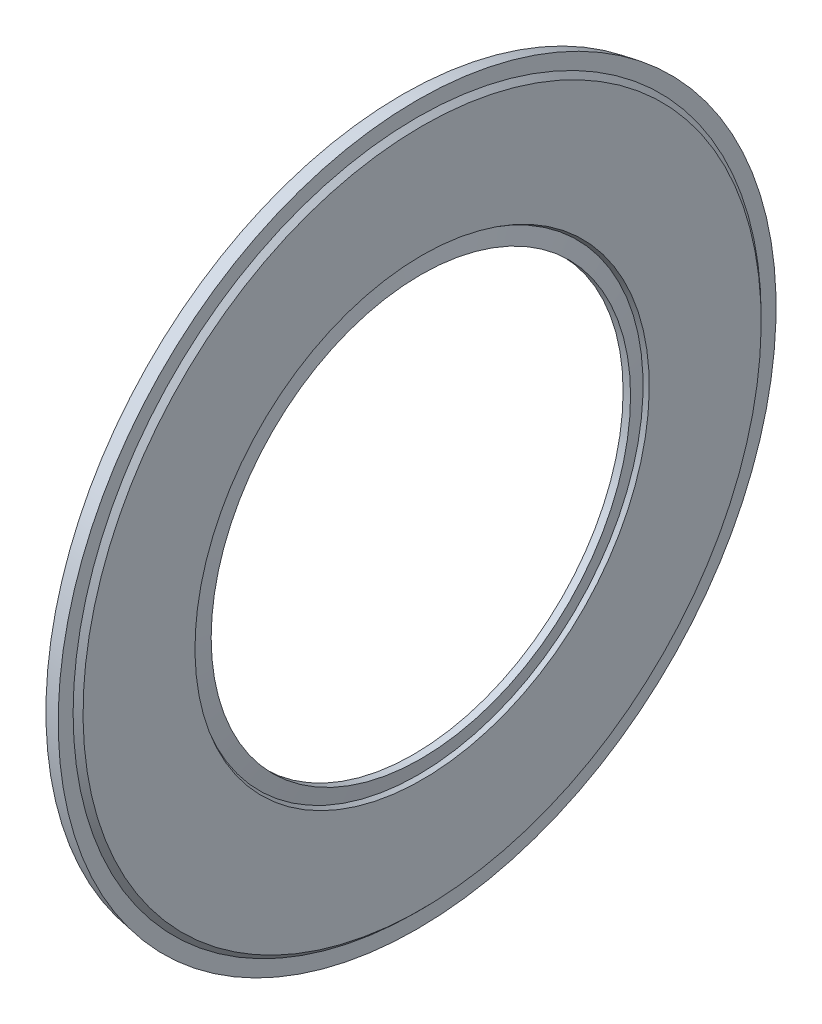
ISO-10303-21;
HEADER;
FILE_DESCRIPTION(('STEP AP214'),'2;1');
FILE_NAME('part.step','',(''),(''),'','','');
FILE_SCHEMA(('AUTOMOTIVE_DESIGN { 1 0 10303 214 1 1 1 1 }'));
ENDSEC;
DATA;
#1=APPLICATION_CONTEXT('core data for automotive mechanical design processes');
#2=APPLICATION_PROTOCOL_DEFINITION('international standard','automotive_design',2000,#1);
#3=PRODUCT_CONTEXT('',#1,'mechanical');
#4=PRODUCT('Part','Part','',(#3));
#5=PRODUCT_RELATED_PRODUCT_CATEGORY('part','',(#4));
#6=PRODUCT_DEFINITION_FORMATION('','',#4);
#7=PRODUCT_DEFINITION_CONTEXT('part definition',#1,'design');
#8=PRODUCT_DEFINITION('design','',#6,#7);
#9=PRODUCT_DEFINITION_SHAPE('','',#8);
#10=(LENGTH_UNIT() NAMED_UNIT(*) SI_UNIT(.MILLI.,.METRE.));
#11=(NAMED_UNIT(*) PLANE_ANGLE_UNIT() SI_UNIT($,.RADIAN.));
#12=(NAMED_UNIT(*) SI_UNIT($,.STERADIAN.) SOLID_ANGLE_UNIT());
#13=UNCERTAINTY_MEASURE_WITH_UNIT(LENGTH_MEASURE(1.E-05),#10,'distance_accuracy_value','');
#14=(GEOMETRIC_REPRESENTATION_CONTEXT(3) GLOBAL_UNCERTAINTY_ASSIGNED_CONTEXT((#13)) GLOBAL_UNIT_ASSIGNED_CONTEXT((#10,
#11,#12)) REPRESENTATION_CONTEXT('',''));
#15=CARTESIAN_POINT('',(0.,0.,0.));
#16=DIRECTION('',(0.,0.,1.));
#17=DIRECTION('',(1.,0.,0.));
#18=AXIS2_PLACEMENT_3D('',#15,#16,#17);
#19=CARTESIAN_POINT('',(5.768,8.20523785952436,0.));
#20=DIRECTION('',(1.,0.,0.));
#21=DIRECTION('',(0.,-1.,0.));
#22=AXIS2_PLACEMENT_3D('',#19,#20,#21);
#23=PLANE('',#22);
#24=CARTESIAN_POINT('',(5.768,0.,0.));
#25=DIRECTION('',(-1.,0.,0.));
#26=DIRECTION('',(0.,1.,0.));
#27=AXIS2_PLACEMENT_3D('',#24,#25,#26);
#28=CIRCLE('',#27,8.03123785952436);
#29=CARTESIAN_POINT('',(5.768,8.03123785952436,0.));
#30=VERTEX_POINT('',#29);
#31=EDGE_CURVE('E11',#30,#30,#28,.T.);
#32=ORIENTED_EDGE('',*,*,#31,.T.);
#33=EDGE_LOOP('',(#32));
#34=FACE_BOUND('',#33,.T.);
#35=CARTESIAN_POINT('',(5.768,0.,0.));
#36=DIRECTION('',(-1.,0.,0.));
#37=DIRECTION('',(0.,1.,0.));
#38=AXIS2_PLACEMENT_3D('',#35,#36,#37);
#39=CIRCLE('',#38,8.37923785952436);
#40=CARTESIAN_POINT('',(5.768,8.37923785952436,0.));
#41=VERTEX_POINT('',#40);
#42=EDGE_CURVE('E65',#41,#41,#39,.T.);
#43=ORIENTED_EDGE('',*,*,#42,.F.);
#44=EDGE_LOOP('',(#43));
#45=FACE_BOUND('',#44,.T.);
#46=ADVANCED_FACE('F16',(#34,#45),#23,.T.);
#47=CARTESIAN_POINT('',(5.826,0.,0.));
#48=DIRECTION('',(-1.,0.,0.));
#49=DIRECTION('',(0.,1.,0.));
#50=AXIS2_PLACEMENT_3D('',#47,#48,#49);
#51=CONICAL_SURFACE('',#50,7.97323785952436,0.785398163397449);
#52=CARTESIAN_POINT('',(5.884,0.,0.));
#53=DIRECTION('',(-1.,0.,0.));
#54=DIRECTION('',(0.,1.,0.));
#55=AXIS2_PLACEMENT_3D('',#52,#53,#54);
#56=CIRCLE('',#55,7.91523785952436);
#57=CARTESIAN_POINT('',(5.884,7.91523785952436,0.));
#58=VERTEX_POINT('',#57);
#59=EDGE_CURVE('E26',#58,#58,#56,.T.);
#60=ORIENTED_EDGE('',*,*,#59,.T.);
#61=EDGE_LOOP('',(#60));
#62=FACE_BOUND('',#61,.T.);
#63=ORIENTED_EDGE('',*,*,#31,.F.);
#64=EDGE_LOOP('',(#63));
#65=FACE_BOUND('',#64,.T.);
#66=ADVANCED_FACE('F96',(#62,#65),#51,.T.);
#67=CARTESIAN_POINT('',(5.884,6.60886892976218,0.));
#68=DIRECTION('',(1.,0.,0.));
#69=DIRECTION('',(0.,-1.,0.));
#70=AXIS2_PLACEMENT_3D('',#67,#68,#69);
#71=PLANE('',#70);
#72=CARTESIAN_POINT('',(5.884,0.,0.));
#73=DIRECTION('',(-1.,0.,0.));
#74=DIRECTION('',(0.,1.,0.));
#75=AXIS2_PLACEMENT_3D('',#72,#73,#74);
#76=CIRCLE('',#75,5.3025);
#77=CARTESIAN_POINT('',(5.884,5.3025,0.));
#78=VERTEX_POINT('',#77);
#79=EDGE_CURVE('E73',#78,#78,#76,.T.);
#80=ORIENTED_EDGE('',*,*,#79,.T.);
#81=EDGE_LOOP('',(#80));
#82=FACE_BOUND('',#81,.T.);
#83=ORIENTED_EDGE('',*,*,#59,.F.);
#84=EDGE_LOOP('',(#83));
#85=FACE_BOUND('',#84,.T.);
#86=ADVANCED_FACE('F102',(#82,#85),#71,.T.);
#87=CARTESIAN_POINT('',(5.83824061101363,0.,0.));
#88=DIRECTION('',(1.,0.,0.));
#89=DIRECTION('',(0.,1.,0.));
#90=AXIS2_PLACEMENT_3D('',#87,#88,#89);
#91=CONICAL_SURFACE('',#90,5.27608080445077,0.523598775598299);
#92=CARTESIAN_POINT('',(5.79248122202726,0.,0.));
#93=DIRECTION('',(-1.,0.,0.));
#94=DIRECTION('',(0.,1.,0.));
#95=AXIS2_PLACEMENT_3D('',#92,#93,#94);
#96=CIRCLE('',#95,5.24966160890153);
#97=CARTESIAN_POINT('',(5.79248122202726,5.24966160890153,0.));
#98=VERTEX_POINT('',#97);
#99=EDGE_CURVE('E71',#98,#98,#96,.T.);
#100=ORIENTED_EDGE('',*,*,#99,.T.);
#101=EDGE_LOOP('',(#100));
#102=FACE_BOUND('',#101,.T.);
#103=ORIENTED_EDGE('',*,*,#79,.F.);
#104=EDGE_LOOP('',(#103));
#105=FACE_BOUND('',#104,.T.);
#106=ADVANCED_FACE('F109',(#102,#105),#91,.F.);
#107=CARTESIAN_POINT('',(5.82374061101363,0.,0.));
#108=DIRECTION('',(-1.,0.,0.));
#109=DIRECTION('',(0.,1.,0.));
#110=AXIS2_PLACEMENT_3D('',#107,#108,#109);
#111=CONICAL_SURFACE('',#110,5.07238080445077,1.39626340159546);
#112=CARTESIAN_POINT('',(5.855,0.,0.));
#113=DIRECTION('',(-1.,0.,0.));
#114=DIRECTION('',(0.,1.,0.));
#115=AXIS2_PLACEMENT_3D('',#112,#113,#114);
#116=CIRCLE('',#115,4.8951);
#117=CARTESIAN_POINT('',(5.855,4.8951,0.));
#118=VERTEX_POINT('',#117);
#119=EDGE_CURVE('E69',#118,#118,#116,.T.);
#120=ORIENTED_EDGE('',*,*,#119,.T.);
#121=EDGE_LOOP('',(#120));
#122=FACE_BOUND('',#121,.T.);
#123=ORIENTED_EDGE('',*,*,#99,.F.);
#124=EDGE_LOOP('',(#123));
#125=FACE_BOUND('',#124,.T.);
#126=ADVANCED_FACE('F128',(#122,#125),#111,.T.);
#127=CARTESIAN_POINT('',(5.768,0.,0.));
#128=DIRECTION('',(1.,0.,0.));
#129=DIRECTION('',(0.,1.,0.));
#130=AXIS2_PLACEMENT_3D('',#127,#128,#129);
#131=CYLINDRICAL_SURFACE('',#130,4.8951);
#132=CARTESIAN_POINT('',(5.681,0.,0.));
#133=DIRECTION('',(-1.,0.,0.));
#134=DIRECTION('',(0.,1.,0.));
#135=AXIS2_PLACEMENT_3D('',#132,#133,#134);
#136=CIRCLE('',#135,4.8951);
#137=CARTESIAN_POINT('',(5.681,4.8951,0.));
#138=VERTEX_POINT('',#137);
#139=EDGE_CURVE('E72',#138,#138,#136,.T.);
#140=ORIENTED_EDGE('',*,*,#139,.T.);
#141=EDGE_LOOP('',(#140));
#142=FACE_BOUND('',#141,.T.);
#143=ORIENTED_EDGE('',*,*,#119,.F.);
#144=EDGE_LOOP('',(#143));
#145=FACE_BOUND('',#144,.T.);
#146=ADVANCED_FACE('F130',(#142,#145),#131,.F.);
#147=CARTESIAN_POINT('',(5.64508219402969,0.,0.));
#148=DIRECTION('',(-1.,0.,0.));
#149=DIRECTION('',(0.,1.,0.));
#150=AXIS2_PLACEMENT_3D('',#147,#148,#149);
#151=CONICAL_SURFACE('',#150,5.0988,1.39626340159546);
#152=CARTESIAN_POINT('',(5.60916438805937,0.,0.));
#153=DIRECTION('',(-1.,0.,0.));
#154=DIRECTION('',(0.,1.,0.));
#155=AXIS2_PLACEMENT_3D('',#152,#153,#154);
#156=CIRCLE('',#155,5.3025);
#157=CARTESIAN_POINT('',(5.60916438805937,5.3025,0.));
#158=VERTEX_POINT('',#157);
#159=EDGE_CURVE('E20',#158,#158,#156,.T.);
#160=ORIENTED_EDGE('',*,*,#159,.T.);
#161=EDGE_LOOP('',(#160));
#162=FACE_BOUND('',#161,.T.);
#163=ORIENTED_EDGE('',*,*,#139,.F.);
#164=EDGE_LOOP('',(#163));
#165=FACE_BOUND('',#164,.T.);
#166=ADVANCED_FACE('F133',(#162,#165),#151,.F.);
#167=CARTESIAN_POINT('',(5.54358219402969,0.,0.));
#168=DIRECTION('',(1.,0.,0.));
#169=DIRECTION('',(0.,1.,0.));
#170=AXIS2_PLACEMENT_3D('',#167,#168,#169);
#171=CYLINDRICAL_SURFACE('',#170,5.3025);
#172=CARTESIAN_POINT('',(5.478,0.,0.));
#173=DIRECTION('',(-1.,0.,0.));
#174=DIRECTION('',(0.,1.,0.));
#175=AXIS2_PLACEMENT_3D('',#172,#173,#174);
#176=CIRCLE('',#175,5.3025);
#177=CARTESIAN_POINT('',(5.478,5.3025,0.));
#178=VERTEX_POINT('',#177);
#179=EDGE_CURVE('E52',#178,#178,#176,.T.);
#180=ORIENTED_EDGE('',*,*,#179,.T.);
#181=EDGE_LOOP('',(#180));
#182=FACE_BOUND('',#181,.T.);
#183=ORIENTED_EDGE('',*,*,#159,.F.);
#184=EDGE_LOOP('',(#183));
#185=FACE_BOUND('',#184,.T.);
#186=ADVANCED_FACE('F112',(#182,#185),#171,.F.);
#187=CARTESIAN_POINT('',(5.478,6.4895,0.));
#188=DIRECTION('',(-1.,0.,0.));
#189=DIRECTION('',(0.,1.,0.));
#190=AXIS2_PLACEMENT_3D('',#187,#188,#189);
#191=PLANE('',#190);
#192=CARTESIAN_POINT('',(5.478,0.,0.));
#193=DIRECTION('',(-1.,0.,0.));
#194=DIRECTION('',(0.,1.,0.));
#195=AXIS2_PLACEMENT_3D('',#192,#193,#194);
#196=CIRCLE('',#195,7.6765);
#197=CARTESIAN_POINT('',(5.478,7.6765,0.));
#198=VERTEX_POINT('',#197);
#199=EDGE_CURVE('E58',#198,#198,#196,.T.);
#200=ORIENTED_EDGE('',*,*,#199,.T.);
#201=EDGE_LOOP('',(#200));
#202=FACE_BOUND('',#201,.T.);
#203=ORIENTED_EDGE('',*,*,#179,.F.);
#204=EDGE_LOOP('',(#203));
#205=FACE_BOUND('',#204,.T.);
#206=ADVANCED_FACE('F59',(#202,#205),#191,.T.);
#207=CARTESIAN_POINT('',(5.449,0.,0.));
#208=DIRECTION('',(-1.,0.,0.));
#209=DIRECTION('',(0.,1.,0.));
#210=AXIS2_PLACEMENT_3D('',#207,#208,#209);
#211=CONICAL_SURFACE('',#210,7.7055,0.785398163397451);
#212=CARTESIAN_POINT('',(5.42,0.,0.));
#213=DIRECTION('',(-1.,0.,0.));
#214=DIRECTION('',(0.,1.,0.));
#215=AXIS2_PLACEMENT_3D('',#212,#213,#214);
#216=CIRCLE('',#215,7.7345);
#217=CARTESIAN_POINT('',(5.42,7.7345,0.));
#218=VERTEX_POINT('',#217);
#219=EDGE_CURVE('E62',#218,#218,#216,.T.);
#220=ORIENTED_EDGE('',*,*,#219,.T.);
#221=EDGE_LOOP('',(#220));
#222=FACE_BOUND('',#221,.T.);
#223=ORIENTED_EDGE('',*,*,#199,.F.);
#224=EDGE_LOOP('',(#223));
#225=FACE_BOUND('',#224,.T.);
#226=ADVANCED_FACE('F111',(#222,#225),#211,.F.);
#227=CARTESIAN_POINT('',(5.42,8.02618803511891,0.));
#228=DIRECTION('',(-1.,0.,0.));
#229=DIRECTION('',(0.,1.,0.));
#230=AXIS2_PLACEMENT_3D('',#227,#228,#229);
#231=PLANE('',#230);
#232=CARTESIAN_POINT('',(5.42,0.,0.));
#233=DIRECTION('',(-1.,0.,0.));
#234=DIRECTION('',(0.,1.,0.));
#235=AXIS2_PLACEMENT_3D('',#232,#233,#234);
#236=CIRCLE('',#235,8.31787607023782);
#237=CARTESIAN_POINT('',(5.42,8.31787607023782,0.));
#238=VERTEX_POINT('',#237);
#239=EDGE_CURVE('E84',#238,#238,#236,.T.);
#240=ORIENTED_EDGE('',*,*,#239,.T.);
#241=EDGE_LOOP('',(#240));
#242=FACE_BOUND('',#241,.T.);
#243=ORIENTED_EDGE('',*,*,#219,.F.);
#244=EDGE_LOOP('',(#243));
#245=FACE_BOUND('',#244,.T.);
#246=ADVANCED_FACE('F18',(#242,#245),#231,.T.);
#247=CARTESIAN_POINT('',(5.594,0.,0.));
#248=DIRECTION('',(1.,0.,0.));
#249=DIRECTION('',(0.,1.,0.));
#250=AXIS2_PLACEMENT_3D('',#247,#248,#249);
#251=CONICAL_SURFACE('',#250,8.34855696488109,0.174532925199437);
#252=ORIENTED_EDGE('',*,*,#42,.T.);
#253=EDGE_LOOP('',(#252));
#254=FACE_BOUND('',#253,.T.);
#255=ORIENTED_EDGE('',*,*,#239,.F.);
#256=EDGE_LOOP('',(#255));
#257=FACE_BOUND('',#256,.T.);
#258=ADVANCED_FACE('F91',(#254,#257),#251,.T.);
#259=CLOSED_SHELL('',(#46,#66,#86,#106,#126,#146,#166,#186,#206,#226,#246,#258));
#260=MANIFOLD_SOLID_BREP('B1',#259);
#261=ADVANCED_BREP_SHAPE_REPRESENTATION('',(#18,#260),#14);
#262=SHAPE_DEFINITION_REPRESENTATION(#9,#261);
ENDSEC;
END-ISO-10303-21;
